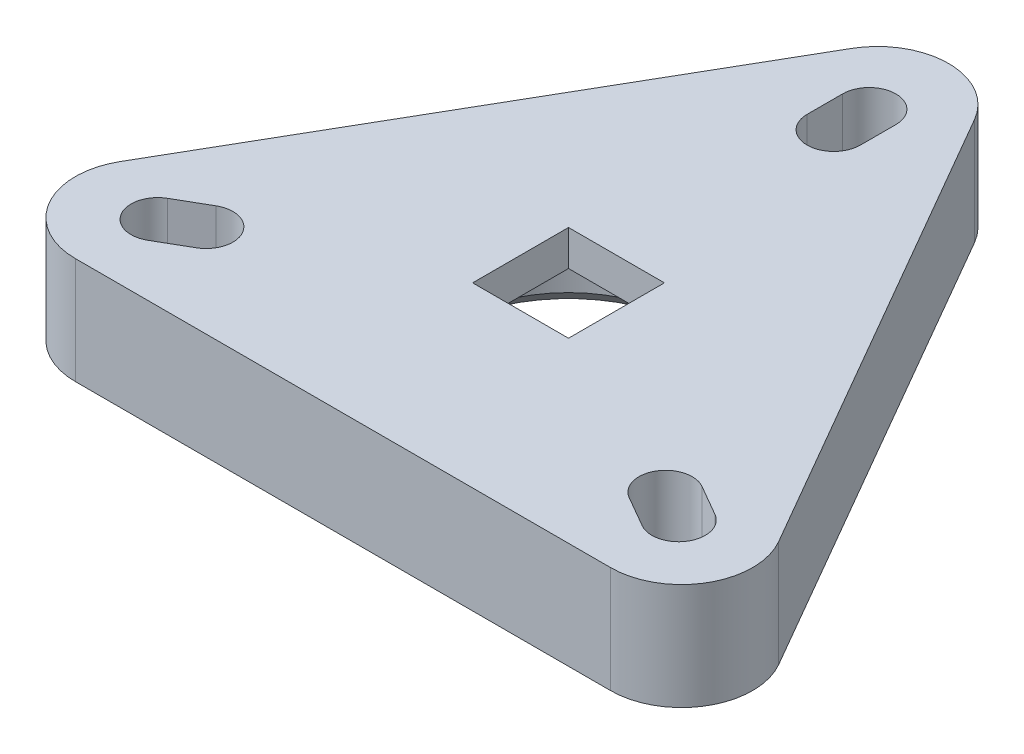
ISO-10303-21;
HEADER;
FILE_DESCRIPTION(('STEP AP214'),'2;1');
FILE_NAME('part.step','',(''),(''),'','','');
FILE_SCHEMA(('AUTOMOTIVE_DESIGN { 1 0 10303 214 1 1 1 1 }'));
ENDSEC;
DATA;
#1=APPLICATION_CONTEXT('core data for automotive mechanical design processes');
#2=APPLICATION_PROTOCOL_DEFINITION('international standard','automotive_design',2000,#1);
#3=PRODUCT_CONTEXT('',#1,'mechanical');
#4=PRODUCT('Part','Part','',(#3));
#5=PRODUCT_RELATED_PRODUCT_CATEGORY('part','',(#4));
#6=PRODUCT_DEFINITION_FORMATION('','',#4);
#7=PRODUCT_DEFINITION_CONTEXT('part definition',#1,'design');
#8=PRODUCT_DEFINITION('design','',#6,#7);
#9=PRODUCT_DEFINITION_SHAPE('','',#8);
#10=(LENGTH_UNIT() NAMED_UNIT(*) SI_UNIT(.MILLI.,.METRE.));
#11=(NAMED_UNIT(*) PLANE_ANGLE_UNIT() SI_UNIT($,.RADIAN.));
#12=(NAMED_UNIT(*) SI_UNIT($,.STERADIAN.) SOLID_ANGLE_UNIT());
#13=UNCERTAINTY_MEASURE_WITH_UNIT(LENGTH_MEASURE(1.E-05),#10,'distance_accuracy_value','');
#14=(GEOMETRIC_REPRESENTATION_CONTEXT(3) GLOBAL_UNCERTAINTY_ASSIGNED_CONTEXT((#13)) GLOBAL_UNIT_ASSIGNED_CONTEXT((#10,
#11,#12)) REPRESENTATION_CONTEXT('',''));
#15=CARTESIAN_POINT('',(0.,0.,0.));
#16=DIRECTION('',(0.,0.,1.));
#17=DIRECTION('',(1.,0.,0.));
#18=AXIS2_PLACEMENT_3D('',#15,#16,#17);
#19=CARTESIAN_POINT('',(0.,7.62,-21.5072816356348));
#20=DIRECTION('',(0.,-1.,0.));
#21=DIRECTION('',(0.,0.,-1.));
#22=AXIS2_PLACEMENT_3D('',#19,#20,#21);
#23=CYLINDRICAL_SURFACE('',#22,1.905);
#24=CARTESIAN_POINT('',(0.,0.,-21.5072816356348));
#25=DIRECTION('',(0.,1.,0.));
#26=DIRECTION('',(0.,0.,1.));
#27=AXIS2_PLACEMENT_3D('',#24,#25,#26);
#28=CIRCLE('',#27,1.905);
#29=CARTESIAN_POINT('',(1.90500000000001,0.,-21.5072816356348));
#30=VERTEX_POINT('',#29);
#31=CARTESIAN_POINT('',(-1.90499999999999,0.,-21.5072816356348));
#32=VERTEX_POINT('',#31);
#33=EDGE_CURVE('E312',#30,#32,#28,.T.);
#34=ORIENTED_EDGE('',*,*,#33,.F.);
#35=DIRECTION('',(0.,-1.,0.));
#36=VECTOR('',#35,1.);
#37=CARTESIAN_POINT('',(1.90500000000001,7.62,-21.5072816356348));
#38=LINE('',#37,#36);
#39=CARTESIAN_POINT('',(1.90500000000001,7.62,-21.5072816356348));
#40=VERTEX_POINT('',#39);
#41=EDGE_CURVE('E330',#40,#30,#38,.T.);
#42=ORIENTED_EDGE('',*,*,#41,.F.);
#43=CARTESIAN_POINT('',(0.,7.62,-21.5072816356348));
#44=DIRECTION('',(0.,1.,0.));
#45=DIRECTION('',(0.,0.,1.));
#46=AXIS2_PLACEMENT_3D('',#43,#44,#45);
#47=CIRCLE('',#46,1.905);
#48=CARTESIAN_POINT('',(-1.90499999999999,7.62,-21.5072816356348));
#49=VERTEX_POINT('',#48);
#50=EDGE_CURVE('E259',#40,#49,#47,.T.);
#51=ORIENTED_EDGE('',*,*,#50,.T.);
#52=DIRECTION('',(0.,-1.,0.));
#53=VECTOR('',#52,1.);
#54=CARTESIAN_POINT('',(-1.90499999999999,7.62,-21.5072816356348));
#55=LINE('',#54,#53);
#56=EDGE_CURVE('E323',#49,#32,#55,.T.);
#57=ORIENTED_EDGE('',*,*,#56,.T.);
#58=EDGE_LOOP('',(#34,#42,#51,#57));
#59=FACE_BOUND('',#58,.T.);
#60=ADVANCED_FACE('F37',(#59),#23,.F.);
#61=CARTESIAN_POINT('',(1.905,7.62,0.));
#62=DIRECTION('',(-1.,0.,0.));
#63=DIRECTION('',(0.,0.,1.));
#64=AXIS2_PLACEMENT_3D('',#61,#62,#63);
#65=PLANE('',#64);
#66=DIRECTION('',(0.,0.,-1.));
#67=VECTOR('',#66,1.);
#68=CARTESIAN_POINT('',(1.905,0.,0.));
#69=LINE('',#68,#67);
#70=CARTESIAN_POINT('',(1.90500000000001,0.,-18.9672816356348));
#71=VERTEX_POINT('',#70);
#72=EDGE_CURVE('E315',#71,#30,#69,.T.);
#73=ORIENTED_EDGE('',*,*,#72,.F.);
#74=DIRECTION('',(0.,-1.,0.));
#75=VECTOR('',#74,1.);
#76=CARTESIAN_POINT('',(1.90500000000001,7.62,-18.9672816356348));
#77=LINE('',#76,#75);
#78=CARTESIAN_POINT('',(1.90500000000001,7.62,-18.9672816356348));
#79=VERTEX_POINT('',#78);
#80=EDGE_CURVE('E328',#79,#71,#77,.T.);
#81=ORIENTED_EDGE('',*,*,#80,.F.);
#82=DIRECTION('',(0.,0.,-1.));
#83=VECTOR('',#82,1.);
#84=CARTESIAN_POINT('',(1.905,7.62,0.));
#85=LINE('',#84,#83);
#86=EDGE_CURVE('E262',#79,#40,#85,.T.);
#87=ORIENTED_EDGE('',*,*,#86,.T.);
#88=ORIENTED_EDGE('',*,*,#41,.T.);
#89=EDGE_LOOP('',(#73,#81,#87,#88));
#90=FACE_BOUND('',#89,.T.);
#91=ADVANCED_FACE('F379',(#90),#65,.T.);
#92=CARTESIAN_POINT('',(0.,7.62,-18.9672816356348));
#93=DIRECTION('',(0.,-1.,0.));
#94=DIRECTION('',(0.,0.,-1.));
#95=AXIS2_PLACEMENT_3D('',#92,#93,#94);
#96=CYLINDRICAL_SURFACE('',#95,1.905);
#97=CARTESIAN_POINT('',(0.,0.,-18.9672816356348));
#98=DIRECTION('',(0.,1.,0.));
#99=DIRECTION('',(0.,0.,1.));
#100=AXIS2_PLACEMENT_3D('',#97,#98,#99);
#101=CIRCLE('',#100,1.905);
#102=CARTESIAN_POINT('',(-1.905,0.,-18.9672816356348));
#103=VERTEX_POINT('',#102);
#104=EDGE_CURVE('E318',#103,#71,#101,.T.);
#105=ORIENTED_EDGE('',*,*,#104,.F.);
#106=DIRECTION('',(0.,-1.,0.));
#107=VECTOR('',#106,1.);
#108=CARTESIAN_POINT('',(-1.905,7.62,-18.9672816356348));
#109=LINE('',#108,#107);
#110=CARTESIAN_POINT('',(-1.905,7.62,-18.9672816356348));
#111=VERTEX_POINT('',#110);
#112=EDGE_CURVE('E325',#111,#103,#109,.T.);
#113=ORIENTED_EDGE('',*,*,#112,.F.);
#114=CARTESIAN_POINT('',(0.,7.62,-18.9672816356348));
#115=DIRECTION('',(0.,1.,0.));
#116=DIRECTION('',(0.,0.,1.));
#117=AXIS2_PLACEMENT_3D('',#114,#115,#116);
#118=CIRCLE('',#117,1.905);
#119=EDGE_CURVE('E265',#111,#79,#118,.T.);
#120=ORIENTED_EDGE('',*,*,#119,.T.);
#121=ORIENTED_EDGE('',*,*,#80,.T.);
#122=EDGE_LOOP('',(#105,#113,#120,#121));
#123=FACE_BOUND('',#122,.T.);
#124=ADVANCED_FACE('F385',(#123),#96,.F.);
#125=CARTESIAN_POINT('',(-16.4261477371938,7.62,9.48364081781738));
#126=DIRECTION('',(0.,-1.,0.));
#127=DIRECTION('',(0.,0.,-1.));
#128=AXIS2_PLACEMENT_3D('',#125,#126,#127);
#129=CYLINDRICAL_SURFACE('',#128,1.905);
#130=CARTESIAN_POINT('',(-16.4261477371938,0.,9.48364081781738));
#131=DIRECTION('',(0.,1.,0.));
#132=DIRECTION('',(0.,0.,1.));
#133=AXIS2_PLACEMENT_3D('',#130,#131,#132);
#134=CIRCLE('',#133,1.905);
#135=CARTESIAN_POINT('',(-15.4736477371938,0.,11.1334192120267));
#136=VERTEX_POINT('',#135);
#137=CARTESIAN_POINT('',(-17.3786477371938,0.,7.83386242360801));
#138=VERTEX_POINT('',#137);
#139=EDGE_CURVE('E300',#136,#138,#134,.T.);
#140=ORIENTED_EDGE('',*,*,#139,.F.);
#141=DIRECTION('',(0.,-1.,0.));
#142=VECTOR('',#141,1.);
#143=CARTESIAN_POINT('',(-15.4736477371938,7.62,11.1334192120267));
#144=LINE('',#143,#142);
#145=CARTESIAN_POINT('',(-15.4736477371938,7.62,11.1334192120267));
#146=VERTEX_POINT('',#145);
#147=EDGE_CURVE('E326',#146,#136,#144,.T.);
#148=ORIENTED_EDGE('',*,*,#147,.F.);
#149=CARTESIAN_POINT('',(-16.4261477371938,7.62,9.48364081781738));
#150=DIRECTION('',(0.,1.,0.));
#151=DIRECTION('',(0.,0.,1.));
#152=AXIS2_PLACEMENT_3D('',#149,#150,#151);
#153=CIRCLE('',#152,1.905);
#154=CARTESIAN_POINT('',(-17.3786477371938,7.62,7.83386242360801));
#155=VERTEX_POINT('',#154);
#156=EDGE_CURVE('E248',#146,#155,#153,.T.);
#157=ORIENTED_EDGE('',*,*,#156,.T.);
#158=DIRECTION('',(0.,-1.,0.));
#159=VECTOR('',#158,1.);
#160=CARTESIAN_POINT('',(-17.3786477371938,7.62,7.83386242360801));
#161=LINE('',#160,#159);
#162=EDGE_CURVE('E333',#155,#138,#161,.T.);
#163=ORIENTED_EDGE('',*,*,#162,.T.);
#164=EDGE_LOOP('',(#140,#148,#157,#163));
#165=FACE_BOUND('',#164,.T.);
#166=ADVANCED_FACE('F405',(#165),#129,.F.);
#167=CARTESIAN_POINT('',(0.952499999999998,7.62,1.64977839420935));
#168=DIRECTION('',(-0.5,0.,-0.866025403784438));
#169=DIRECTION('',(-0.866025403784439,0.,0.5));
#170=AXIS2_PLACEMENT_3D('',#167,#168,#169);
#171=PLANE('',#170);
#172=DIRECTION('',(0.866025403784439,0.,-0.5));
#173=VECTOR('',#172,1.);
#174=CARTESIAN_POINT('',(0.952499999999998,0.,1.64977839420935));
#175=LINE('',#174,#173);
#176=CARTESIAN_POINT('',(-17.6733522628062,0.,12.4034192120267));
#177=VERTEX_POINT('',#176);
#178=EDGE_CURVE('E303',#177,#136,#175,.T.);
#179=ORIENTED_EDGE('',*,*,#178,.F.);
#180=DIRECTION('',(0.,-1.,0.));
#181=VECTOR('',#180,1.);
#182=CARTESIAN_POINT('',(-17.6733522628062,7.62,12.4034192120267));
#183=LINE('',#182,#181);
#184=CARTESIAN_POINT('',(-17.6733522628062,7.62,12.4034192120267));
#185=VERTEX_POINT('',#184);
#186=EDGE_CURVE('E338',#185,#177,#183,.T.);
#187=ORIENTED_EDGE('',*,*,#186,.F.);
#188=DIRECTION('',(0.866025403784439,0.,-0.5));
#189=VECTOR('',#188,1.);
#190=CARTESIAN_POINT('',(0.952499999999998,7.62,1.64977839420935));
#191=LINE('',#190,#189);
#192=EDGE_CURVE('E251',#185,#146,#191,.T.);
#193=ORIENTED_EDGE('',*,*,#192,.T.);
#194=ORIENTED_EDGE('',*,*,#147,.T.);
#195=EDGE_LOOP('',(#179,#187,#193,#194));
#196=FACE_BOUND('',#195,.T.);
#197=ADVANCED_FACE('F401',(#196),#171,.T.);
#198=CARTESIAN_POINT('',(-18.6258522628062,7.62,10.7536408178174));
#199=DIRECTION('',(0.,-1.,0.));
#200=DIRECTION('',(0.,0.,-1.));
#201=AXIS2_PLACEMENT_3D('',#198,#199,#200);
#202=CYLINDRICAL_SURFACE('',#201,1.905);
#203=CARTESIAN_POINT('',(-18.6258522628062,0.,10.7536408178174));
#204=DIRECTION('',(0.,1.,0.));
#205=DIRECTION('',(0.,0.,1.));
#206=AXIS2_PLACEMENT_3D('',#203,#204,#205);
#207=CIRCLE('',#206,1.905);
#208=CARTESIAN_POINT('',(-19.5783522628062,0.,9.10386242360802));
#209=VERTEX_POINT('',#208);
#210=EDGE_CURVE('E306',#209,#177,#207,.T.);
#211=ORIENTED_EDGE('',*,*,#210,.F.);
#212=DIRECTION('',(0.,-1.,0.));
#213=VECTOR('',#212,1.);
#214=CARTESIAN_POINT('',(-19.5783522628062,7.62,9.10386242360802));
#215=LINE('',#214,#213);
#216=CARTESIAN_POINT('',(-19.5783522628062,7.62,9.10386242360802));
#217=VERTEX_POINT('',#216);
#218=EDGE_CURVE('E335',#217,#209,#215,.T.);
#219=ORIENTED_EDGE('',*,*,#218,.F.);
#220=CARTESIAN_POINT('',(-18.6258522628062,7.62,10.7536408178174));
#221=DIRECTION('',(0.,1.,0.));
#222=DIRECTION('',(0.,0.,1.));
#223=AXIS2_PLACEMENT_3D('',#220,#221,#222);
#224=CIRCLE('',#223,1.905);
#225=EDGE_CURVE('E254',#217,#185,#224,.T.);
#226=ORIENTED_EDGE('',*,*,#225,.T.);
#227=ORIENTED_EDGE('',*,*,#186,.T.);
#228=EDGE_LOOP('',(#211,#219,#226,#227));
#229=FACE_BOUND('',#228,.T.);
#230=ADVANCED_FACE('F397',(#229),#202,.F.);
#231=CARTESIAN_POINT('',(18.6258522628062,7.62,10.7536408178174));
#232=DIRECTION('',(0.,-1.,0.));
#233=DIRECTION('',(0.,0.,-1.));
#234=AXIS2_PLACEMENT_3D('',#231,#232,#233);
#235=CYLINDRICAL_SURFACE('',#234,1.905);
#236=CARTESIAN_POINT('',(18.6258522628062,0.,10.7536408178174));
#237=DIRECTION('',(0.,1.,0.));
#238=DIRECTION('',(0.,0.,1.));
#239=AXIS2_PLACEMENT_3D('',#236,#237,#238);
#240=CIRCLE('',#239,1.905);
#241=CARTESIAN_POINT('',(17.6733522628062,0.,12.4034192120267));
#242=VERTEX_POINT('',#241);
#243=CARTESIAN_POINT('',(19.5783522628062,0.,9.10386242360802));
#244=VERTEX_POINT('',#243);
#245=EDGE_CURVE('E288',#242,#244,#240,.T.);
#246=ORIENTED_EDGE('',*,*,#245,.F.);
#247=DIRECTION('',(0.,-1.,0.));
#248=VECTOR('',#247,1.);
#249=CARTESIAN_POINT('',(17.6733522628062,7.62,12.4034192120267));
#250=LINE('',#249,#248);
#251=CARTESIAN_POINT('',(17.6733522628062,7.62,12.4034192120267));
#252=VERTEX_POINT('',#251);
#253=EDGE_CURVE('E336',#252,#242,#250,.T.);
#254=ORIENTED_EDGE('',*,*,#253,.F.);
#255=CARTESIAN_POINT('',(18.6258522628062,7.62,10.7536408178174));
#256=DIRECTION('',(0.,1.,0.));
#257=DIRECTION('',(0.,0.,1.));
#258=AXIS2_PLACEMENT_3D('',#255,#256,#257);
#259=CIRCLE('',#258,1.905);
#260=CARTESIAN_POINT('',(19.5783522628062,7.62,9.10386242360802));
#261=VERTEX_POINT('',#260);
#262=EDGE_CURVE('E237',#252,#261,#259,.T.);
#263=ORIENTED_EDGE('',*,*,#262,.T.);
#264=DIRECTION('',(0.,-1.,0.));
#265=VECTOR('',#264,1.);
#266=CARTESIAN_POINT('',(19.5783522628062,7.62,9.10386242360802));
#267=LINE('',#266,#265);
#268=EDGE_CURVE('E341',#261,#244,#267,.T.);
#269=ORIENTED_EDGE('',*,*,#268,.T.);
#270=EDGE_LOOP('',(#246,#254,#263,#269));
#271=FACE_BOUND('',#270,.T.);
#272=ADVANCED_FACE('F400',(#271),#235,.F.);
#273=CARTESIAN_POINT('',(-0.952500000000003,7.62,1.64977839420936));
#274=DIRECTION('',(0.5,0.,-0.866025403784439));
#275=DIRECTION('',(-0.866025403784439,0.,-0.5));
#276=AXIS2_PLACEMENT_3D('',#273,#274,#275);
#277=PLANE('',#276);
#278=DIRECTION('',(0.866025403784439,0.,0.5));
#279=VECTOR('',#278,1.);
#280=CARTESIAN_POINT('',(-0.952500000000003,0.,1.64977839420936));
#281=LINE('',#280,#279);
#282=CARTESIAN_POINT('',(15.4736477371937,0.,11.1334192120267));
#283=VERTEX_POINT('',#282);
#284=EDGE_CURVE('E291',#283,#242,#281,.T.);
#285=ORIENTED_EDGE('',*,*,#284,.F.);
#286=DIRECTION('',(0.,-1.,0.));
#287=VECTOR('',#286,1.);
#288=CARTESIAN_POINT('',(15.4736477371937,7.62,11.1334192120267));
#289=LINE('',#288,#287);
#290=CARTESIAN_POINT('',(15.4736477371937,7.62,11.1334192120267));
#291=VERTEX_POINT('',#290);
#292=EDGE_CURVE('E346',#291,#283,#289,.T.);
#293=ORIENTED_EDGE('',*,*,#292,.F.);
#294=DIRECTION('',(0.866025403784439,0.,0.5));
#295=VECTOR('',#294,1.);
#296=CARTESIAN_POINT('',(-0.952500000000003,7.62,1.64977839420936));
#297=LINE('',#296,#295);
#298=EDGE_CURVE('E240',#291,#252,#297,.T.);
#299=ORIENTED_EDGE('',*,*,#298,.T.);
#300=ORIENTED_EDGE('',*,*,#253,.T.);
#301=EDGE_LOOP('',(#285,#293,#299,#300));
#302=FACE_BOUND('',#301,.T.);
#303=ADVANCED_FACE('F418',(#302),#277,.T.);
#304=CARTESIAN_POINT('',(16.4261477371937,7.62,9.48364081781738));
#305=DIRECTION('',(0.,-1.,0.));
#306=DIRECTION('',(0.,0.,-1.));
#307=AXIS2_PLACEMENT_3D('',#304,#305,#306);
#308=CYLINDRICAL_SURFACE('',#307,1.905);
#309=CARTESIAN_POINT('',(16.4261477371937,0.,9.48364081781738));
#310=DIRECTION('',(0.,1.,0.));
#311=DIRECTION('',(0.,0.,1.));
#312=AXIS2_PLACEMENT_3D('',#309,#310,#311);
#313=CIRCLE('',#312,1.905);
#314=CARTESIAN_POINT('',(17.3786477371937,0.,7.83386242360802));
#315=VERTEX_POINT('',#314);
#316=EDGE_CURVE('E294',#315,#283,#313,.T.);
#317=ORIENTED_EDGE('',*,*,#316,.F.);
#318=DIRECTION('',(0.,-1.,0.));
#319=VECTOR('',#318,1.);
#320=CARTESIAN_POINT('',(17.3786477371937,7.62,7.83386242360802));
#321=LINE('',#320,#319);
#322=CARTESIAN_POINT('',(17.3786477371937,7.62,7.83386242360802));
#323=VERTEX_POINT('',#322);
#324=EDGE_CURVE('E343',#323,#315,#321,.T.);
#325=ORIENTED_EDGE('',*,*,#324,.F.);
#326=CARTESIAN_POINT('',(16.4261477371937,7.62,9.48364081781738));
#327=DIRECTION('',(0.,1.,0.));
#328=DIRECTION('',(0.,0.,1.));
#329=AXIS2_PLACEMENT_3D('',#326,#327,#328);
#330=CIRCLE('',#329,1.905);
#331=EDGE_CURVE('E243',#323,#291,#330,.T.);
#332=ORIENTED_EDGE('',*,*,#331,.T.);
#333=ORIENTED_EDGE('',*,*,#292,.T.);
#334=EDGE_LOOP('',(#317,#325,#332,#333));
#335=FACE_BOUND('',#334,.T.);
#336=ADVANCED_FACE('F414',(#335),#308,.F.);
#337=CARTESIAN_POINT('',(0.,7.62,-22.1023330423163));
#338=DIRECTION('',(0.,-1.,0.));
#339=DIRECTION('',(0.,0.,-1.));
#340=AXIS2_PLACEMENT_3D('',#337,#338,#339);
#341=CYLINDRICAL_SURFACE('',#340,5.08);
#342=CARTESIAN_POINT('',(0.,0.,-22.1023330423163));
#343=DIRECTION('',(0.,1.,0.));
#344=DIRECTION('',(0.,0.,1.));
#345=AXIS2_PLACEMENT_3D('',#342,#343,#344);
#346=CIRCLE('',#345,5.08);
#347=CARTESIAN_POINT('',(-4.39940905122494,0.,-24.6423330423163));
#348=VERTEX_POINT('',#347);
#349=CARTESIAN_POINT('',(4.39940905122496,0.,-24.6423330423163));
#350=VERTEX_POINT('',#349);
#351=EDGE_CURVE('E218',#348,#350,#346,.F.);
#352=ORIENTED_EDGE('',*,*,#351,.F.);
#353=DIRECTION('',(0.,-1.,0.));
#354=VECTOR('',#353,1.);
#355=CARTESIAN_POINT('',(-4.39940905122494,7.62,-24.6423330423163));
#356=LINE('',#355,#354);
#357=CARTESIAN_POINT('',(-4.39940905122494,7.62,-24.6423330423163));
#358=VERTEX_POINT('',#357);
#359=EDGE_CURVE('E344',#358,#348,#356,.T.);
#360=ORIENTED_EDGE('',*,*,#359,.F.);
#361=CARTESIAN_POINT('',(0.,7.62,-22.1023330423163));
#362=DIRECTION('',(0.,1.,0.));
#363=DIRECTION('',(0.,0.,1.));
#364=AXIS2_PLACEMENT_3D('',#361,#362,#363);
#365=CIRCLE('',#364,5.08);
#366=CARTESIAN_POINT('',(4.39940905122496,7.62,-24.6423330423163));
#367=VERTEX_POINT('',#366);
#368=EDGE_CURVE('E219',#358,#367,#365,.F.);
#369=ORIENTED_EDGE('',*,*,#368,.T.);
#370=DIRECTION('',(0.,-1.,0.));
#371=VECTOR('',#370,1.);
#372=CARTESIAN_POINT('',(4.39940905122496,7.62,-24.6423330423163));
#373=LINE('',#372,#371);
#374=EDGE_CURVE('E270',#367,#350,#373,.T.);
#375=ORIENTED_EDGE('',*,*,#374,.T.);
#376=EDGE_LOOP('',(#352,#360,#369,#375));
#377=FACE_BOUND('',#376,.T.);
#378=ADVANCED_FACE('F417',(#377),#341,.T.);
#379=CARTESIAN_POINT('',(-13.97,7.62,-8.06558326057907));
#380=DIRECTION('',(-0.866025403784439,0.,-0.5));
#381=DIRECTION('',(-0.5,0.,0.866025403784439));
#382=AXIS2_PLACEMENT_3D('',#379,#380,#381);
#383=PLANE('',#382);
#384=DIRECTION('',(0.5,0.,-0.866025403784439));
#385=VECTOR('',#384,1.);
#386=CARTESIAN_POINT('',(-13.97,0.,-8.06558326057907));
#387=LINE('',#386,#385);
#388=CARTESIAN_POINT('',(-23.5405909487751,0.,8.51116652115814));
#389=VERTEX_POINT('',#388);
#390=EDGE_CURVE('E273',#389,#348,#387,.T.);
#391=ORIENTED_EDGE('',*,*,#390,.F.);
#392=DIRECTION('',(0.,-1.,0.));
#393=VECTOR('',#392,1.);
#394=CARTESIAN_POINT('',(-23.5405909487751,7.62,8.51116652115814));
#395=LINE('',#394,#393);
#396=CARTESIAN_POINT('',(-23.5405909487751,7.62,8.51116652115814));
#397=VERTEX_POINT('',#396);
#398=EDGE_CURVE('E356',#397,#389,#395,.T.);
#399=ORIENTED_EDGE('',*,*,#398,.F.);
#400=DIRECTION('',(0.5,0.,-0.866025403784439));
#401=VECTOR('',#400,1.);
#402=CARTESIAN_POINT('',(-13.97,7.62,-8.06558326057907));
#403=LINE('',#402,#401);
#404=EDGE_CURVE('E222',#397,#358,#403,.T.);
#405=ORIENTED_EDGE('',*,*,#404,.T.);
#406=ORIENTED_EDGE('',*,*,#359,.T.);
#407=EDGE_LOOP('',(#391,#399,#405,#406));
#408=FACE_BOUND('',#407,.T.);
#409=ADVANCED_FACE('F440',(#408),#383,.T.);
#410=CARTESIAN_POINT('',(-19.1411818975501,7.62,11.0511665211581));
#411=DIRECTION('',(0.,-1.,0.));
#412=DIRECTION('',(0.,0.,-1.));
#413=AXIS2_PLACEMENT_3D('',#410,#411,#412);
#414=CYLINDRICAL_SURFACE('',#413,5.08);
#415=CARTESIAN_POINT('',(-19.1411818975501,0.,11.0511665211581));
#416=DIRECTION('',(0.,1.,0.));
#417=DIRECTION('',(0.,0.,1.));
#418=AXIS2_PLACEMENT_3D('',#415,#416,#417);
#419=CIRCLE('',#418,5.08);
#420=CARTESIAN_POINT('',(-19.1411818975501,0.,16.1311665211581));
#421=VERTEX_POINT('',#420);
#422=EDGE_CURVE('E276',#389,#421,#419,.T.);
#423=ORIENTED_EDGE('',*,*,#422,.T.);
#424=DIRECTION('',(0.,-1.,0.));
#425=VECTOR('',#424,1.);
#426=CARTESIAN_POINT('',(-19.1411818975501,7.62,16.1311665211581));
#427=LINE('',#426,#425);
#428=CARTESIAN_POINT('',(-19.1411818975501,7.62,16.1311665211581));
#429=VERTEX_POINT('',#428);
#430=EDGE_CURVE('E354',#429,#421,#427,.T.);
#431=ORIENTED_EDGE('',*,*,#430,.F.);
#432=CARTESIAN_POINT('',(-19.1411818975501,7.62,11.0511665211581));
#433=DIRECTION('',(0.,1.,0.));
#434=DIRECTION('',(0.,0.,1.));
#435=AXIS2_PLACEMENT_3D('',#432,#433,#434);
#436=CIRCLE('',#435,5.08);
#437=EDGE_CURVE('E226',#397,#429,#436,.T.);
#438=ORIENTED_EDGE('',*,*,#437,.F.);
#439=ORIENTED_EDGE('',*,*,#398,.T.);
#440=EDGE_LOOP('',(#423,#431,#438,#439));
#441=FACE_BOUND('',#440,.T.);
#442=ADVANCED_FACE('F436',(#441),#414,.T.);
#443=CARTESIAN_POINT('',(0.,7.62,16.1311665211581));
#444=DIRECTION('',(0.,0.,1.));
#445=DIRECTION('',(1.,0.,0.));
#446=AXIS2_PLACEMENT_3D('',#443,#444,#445);
#447=PLANE('',#446);
#448=DIRECTION('',(-1.,0.,0.));
#449=VECTOR('',#448,1.);
#450=CARTESIAN_POINT('',(0.,0.,16.1311665211581));
#451=LINE('',#450,#449);
#452=CARTESIAN_POINT('',(19.1411818975501,0.,16.1311665211581));
#453=VERTEX_POINT('',#452);
#454=EDGE_CURVE('E279',#453,#421,#451,.T.);
#455=ORIENTED_EDGE('',*,*,#454,.F.);
#456=DIRECTION('',(0.,-1.,0.));
#457=VECTOR('',#456,1.);
#458=CARTESIAN_POINT('',(19.1411818975501,7.62,16.1311665211581));
#459=LINE('',#458,#457);
#460=CARTESIAN_POINT('',(19.1411818975501,7.62,16.1311665211581));
#461=VERTEX_POINT('',#460);
#462=EDGE_CURVE('E352',#461,#453,#459,.T.);
#463=ORIENTED_EDGE('',*,*,#462,.F.);
#464=DIRECTION('',(-1.,0.,0.));
#465=VECTOR('',#464,1.);
#466=CARTESIAN_POINT('',(0.,7.62,16.1311665211581));
#467=LINE('',#466,#465);
#468=EDGE_CURVE('E228',#461,#429,#467,.T.);
#469=ORIENTED_EDGE('',*,*,#468,.T.);
#470=ORIENTED_EDGE('',*,*,#430,.T.);
#471=EDGE_LOOP('',(#455,#463,#469,#470));
#472=FACE_BOUND('',#471,.T.);
#473=ADVANCED_FACE('F432',(#472),#447,.T.);
#474=CARTESIAN_POINT('',(19.1411818975501,7.62,11.0511665211581));
#475=DIRECTION('',(0.,-1.,0.));
#476=DIRECTION('',(0.,0.,-1.));
#477=AXIS2_PLACEMENT_3D('',#474,#475,#476);
#478=CYLINDRICAL_SURFACE('',#477,5.08);
#479=CARTESIAN_POINT('',(19.1411818975501,0.,11.0511665211581));
#480=DIRECTION('',(0.,1.,0.));
#481=DIRECTION('',(0.,0.,1.));
#482=AXIS2_PLACEMENT_3D('',#479,#480,#481);
#483=CIRCLE('',#482,5.08);
#484=CARTESIAN_POINT('',(23.5405909487751,0.,8.51116652115815));
#485=VERTEX_POINT('',#484);
#486=EDGE_CURVE('E282',#485,#453,#483,.F.);
#487=ORIENTED_EDGE('',*,*,#486,.F.);
#488=DIRECTION('',(0.,-1.,0.));
#489=VECTOR('',#488,1.);
#490=CARTESIAN_POINT('',(23.5405909487751,7.62,8.51116652115815));
#491=LINE('',#490,#489);
#492=CARTESIAN_POINT('',(23.5405909487751,7.62,8.51116652115815));
#493=VERTEX_POINT('',#492);
#494=EDGE_CURVE('E350',#493,#485,#491,.T.);
#495=ORIENTED_EDGE('',*,*,#494,.F.);
#496=CARTESIAN_POINT('',(19.1411818975501,7.62,11.0511665211581));
#497=DIRECTION('',(0.,1.,0.));
#498=DIRECTION('',(0.,0.,1.));
#499=AXIS2_PLACEMENT_3D('',#496,#497,#498);
#500=CIRCLE('',#499,5.08);
#501=EDGE_CURVE('E231',#493,#461,#500,.F.);
#502=ORIENTED_EDGE('',*,*,#501,.T.);
#503=ORIENTED_EDGE('',*,*,#462,.T.);
#504=EDGE_LOOP('',(#487,#495,#502,#503));
#505=FACE_BOUND('',#504,.T.);
#506=ADVANCED_FACE('F395',(#505),#478,.T.);
#507=CARTESIAN_POINT('',(-0.952500000000005,7.62,-1.64977839420936));
#508=DIRECTION('',(-0.5,0.,-0.866025403784439));
#509=DIRECTION('',(-0.866025403784439,0.,0.5));
#510=AXIS2_PLACEMENT_3D('',#507,#508,#509);
#511=PLANE('',#510);
#512=DIRECTION('',(0.866025403784439,0.,-0.5));
#513=VECTOR('',#512,1.);
#514=CARTESIAN_POINT('',(-0.952500000000005,0.,-1.64977839420936));
#515=LINE('',#514,#513);
#516=EDGE_CURVE('E309',#209,#138,#515,.T.);
#517=ORIENTED_EDGE('',*,*,#516,.T.);
#518=ORIENTED_EDGE('',*,*,#162,.F.);
#519=DIRECTION('',(0.866025403784439,0.,-0.5));
#520=VECTOR('',#519,1.);
#521=CARTESIAN_POINT('',(-0.952500000000005,7.62,-1.64977839420936));
#522=LINE('',#521,#520);
#523=EDGE_CURVE('E257',#217,#155,#522,.T.);
#524=ORIENTED_EDGE('',*,*,#523,.F.);
#525=ORIENTED_EDGE('',*,*,#218,.T.);
#526=EDGE_LOOP('',(#517,#518,#524,#525));
#527=FACE_BOUND('',#526,.T.);
#528=ADVANCED_FACE('F391',(#527),#511,.F.);
#529=CARTESIAN_POINT('',(0.952499999999999,7.62,-1.64977839420935));
#530=DIRECTION('',(0.5,0.,-0.866025403784439));
#531=DIRECTION('',(-0.866025403784439,0.,-0.5));
#532=AXIS2_PLACEMENT_3D('',#529,#530,#531);
#533=PLANE('',#532);
#534=DIRECTION('',(0.866025403784439,0.,0.5));
#535=VECTOR('',#534,1.);
#536=CARTESIAN_POINT('',(0.952499999999999,0.,-1.64977839420935));
#537=LINE('',#536,#535);
#538=EDGE_CURVE('E297',#315,#244,#537,.T.);
#539=ORIENTED_EDGE('',*,*,#538,.T.);
#540=ORIENTED_EDGE('',*,*,#268,.F.);
#541=DIRECTION('',(0.866025403784439,0.,0.5));
#542=VECTOR('',#541,1.);
#543=CARTESIAN_POINT('',(0.952499999999999,7.62,-1.64977839420935));
#544=LINE('',#543,#542);
#545=EDGE_CURVE('E246',#323,#261,#544,.T.);
#546=ORIENTED_EDGE('',*,*,#545,.F.);
#547=ORIENTED_EDGE('',*,*,#324,.T.);
#548=EDGE_LOOP('',(#539,#540,#546,#547));
#549=FACE_BOUND('',#548,.T.);
#550=ADVANCED_FACE('F394',(#549),#533,.F.);
#551=CARTESIAN_POINT('',(13.97,7.62,-8.06558326057907));
#552=DIRECTION('',(0.866025403784439,0.,-0.5));
#553=DIRECTION('',(-0.5,0.,-0.866025403784439));
#554=AXIS2_PLACEMENT_3D('',#551,#552,#553);
#555=PLANE('',#554);
#556=DIRECTION('',(0.5,0.,0.866025403784439));
#557=VECTOR('',#556,1.);
#558=CARTESIAN_POINT('',(13.97,0.,-8.06558326057907));
#559=LINE('',#558,#557);
#560=EDGE_CURVE('E285',#350,#485,#559,.T.);
#561=ORIENTED_EDGE('',*,*,#560,.F.);
#562=ORIENTED_EDGE('',*,*,#374,.F.);
#563=DIRECTION('',(0.5,0.,0.866025403784439));
#564=VECTOR('',#563,1.);
#565=CARTESIAN_POINT('',(13.97,7.62,-8.06558326057907));
#566=LINE('',#565,#564);
#567=EDGE_CURVE('E234',#367,#493,#566,.T.);
#568=ORIENTED_EDGE('',*,*,#567,.T.);
#569=ORIENTED_EDGE('',*,*,#494,.T.);
#570=EDGE_LOOP('',(#561,#562,#568,#569));
#571=FACE_BOUND('',#570,.T.);
#572=ADVANCED_FACE('F412',(#571),#555,.T.);
#573=CARTESIAN_POINT('',(-1.905,7.62,0.));
#574=DIRECTION('',(-1.,0.,0.));
#575=DIRECTION('',(0.,0.,1.));
#576=AXIS2_PLACEMENT_3D('',#573,#574,#575);
#577=PLANE('',#576);
#578=DIRECTION('',(0.,0.,-1.));
#579=VECTOR('',#578,1.);
#580=CARTESIAN_POINT('',(-1.905,0.,0.));
#581=LINE('',#580,#579);
#582=EDGE_CURVE('E223',#103,#32,#581,.T.);
#583=ORIENTED_EDGE('',*,*,#582,.T.);
#584=ORIENTED_EDGE('',*,*,#56,.F.);
#585=DIRECTION('',(0.,0.,-1.));
#586=VECTOR('',#585,1.);
#587=CARTESIAN_POINT('',(-1.905,7.62,0.));
#588=LINE('',#587,#586);
#589=EDGE_CURVE('E268',#111,#49,#588,.T.);
#590=ORIENTED_EDGE('',*,*,#589,.F.);
#591=ORIENTED_EDGE('',*,*,#112,.T.);
#592=EDGE_LOOP('',(#583,#584,#590,#591));
#593=FACE_BOUND('',#592,.T.);
#594=ADVANCED_FACE('F428',(#593),#577,.F.);
#595=CARTESIAN_POINT('',(0.,7.62,0.));
#596=DIRECTION('',(0.,1.,0.));
#597=DIRECTION('',(0.,0.,1.));
#598=AXIS2_PLACEMENT_3D('',#595,#596,#597);
#599=PLANE('',#598);
#600=DIRECTION('',(0.,0.,1.));
#601=VECTOR('',#600,1.);
#602=CARTESIAN_POINT('',(3.429,7.62,-3.429));
#603=LINE('',#602,#601);
#604=CARTESIAN_POINT('',(3.429,7.62,-3.429));
#605=VERTEX_POINT('',#604);
#606=CARTESIAN_POINT('',(3.429,7.62,3.429));
#607=VERTEX_POINT('',#606);
#608=EDGE_CURVE('E189',#605,#607,#603,.T.);
#609=ORIENTED_EDGE('',*,*,#608,.T.);
#610=DIRECTION('',(-1.,0.,0.));
#611=VECTOR('',#610,1.);
#612=CARTESIAN_POINT('',(-3.429,7.62,3.429));
#613=LINE('',#612,#611);
#614=CARTESIAN_POINT('',(-3.429,7.62,3.429));
#615=VERTEX_POINT('',#614);
#616=EDGE_CURVE('E198',#607,#615,#613,.T.);
#617=ORIENTED_EDGE('',*,*,#616,.T.);
#618=DIRECTION('',(0.,0.,-1.));
#619=VECTOR('',#618,1.);
#620=CARTESIAN_POINT('',(-3.429,7.62,-3.429));
#621=LINE('',#620,#619);
#622=CARTESIAN_POINT('',(-3.429,7.62,-3.429));
#623=VERTEX_POINT('',#622);
#624=EDGE_CURVE('E52',#615,#623,#621,.T.);
#625=ORIENTED_EDGE('',*,*,#624,.T.);
#626=DIRECTION('',(1.,0.,0.));
#627=VECTOR('',#626,1.);
#628=CARTESIAN_POINT('',(-3.429,7.62,-3.429));
#629=LINE('',#628,#627);
#630=EDGE_CURVE('E195',#623,#605,#629,.T.);
#631=ORIENTED_EDGE('',*,*,#630,.T.);
#632=EDGE_LOOP('',(#609,#617,#625,#631));
#633=FACE_BOUND('',#632,.T.);
#634=ORIENTED_EDGE('',*,*,#368,.F.);
#635=ORIENTED_EDGE('',*,*,#404,.F.);
#636=ORIENTED_EDGE('',*,*,#437,.T.);
#637=ORIENTED_EDGE('',*,*,#468,.F.);
#638=ORIENTED_EDGE('',*,*,#501,.F.);
#639=ORIENTED_EDGE('',*,*,#567,.F.);
#640=EDGE_LOOP('',(#634,#635,#636,#637,#638,#639));
#641=FACE_BOUND('',#640,.T.);
#642=ORIENTED_EDGE('',*,*,#262,.F.);
#643=ORIENTED_EDGE('',*,*,#298,.F.);
#644=ORIENTED_EDGE('',*,*,#331,.F.);
#645=ORIENTED_EDGE('',*,*,#545,.T.);
#646=EDGE_LOOP('',(#642,#643,#644,#645));
#647=FACE_BOUND('',#646,.T.);
#648=ORIENTED_EDGE('',*,*,#156,.F.);
#649=ORIENTED_EDGE('',*,*,#192,.F.);
#650=ORIENTED_EDGE('',*,*,#225,.F.);
#651=ORIENTED_EDGE('',*,*,#523,.T.);
#652=EDGE_LOOP('',(#648,#649,#650,#651));
#653=FACE_BOUND('',#652,.T.);
#654=ORIENTED_EDGE('',*,*,#50,.F.);
#655=ORIENTED_EDGE('',*,*,#86,.F.);
#656=ORIENTED_EDGE('',*,*,#119,.F.);
#657=ORIENTED_EDGE('',*,*,#589,.T.);
#658=EDGE_LOOP('',(#654,#655,#656,#657));
#659=FACE_BOUND('',#658,.T.);
#660=ADVANCED_FACE('F202',(#633,#641,#647,#653,#659),#599,.T.);
#661=CARTESIAN_POINT('',(0.,0.,0.));
#662=DIRECTION('',(0.,1.,0.));
#663=DIRECTION('',(0.,0.,1.));
#664=AXIS2_PLACEMENT_3D('',#661,#662,#663);
#665=PLANE('',#664);
#666=CARTESIAN_POINT('',(0.,0.,0.));
#667=DIRECTION('',(0.,1.,0.));
#668=DIRECTION('',(0.,0.,1.));
#669=AXIS2_PLACEMENT_3D('',#666,#667,#668);
#670=CIRCLE('',#669,9.39800000000001);
#671=CARTESIAN_POINT('',(0.,0.,9.39800000000001));
#672=VERTEX_POINT('',#671);
#673=EDGE_CURVE('E11',#672,#672,#670,.T.);
#674=ORIENTED_EDGE('',*,*,#673,.T.);
#675=EDGE_LOOP('',(#674));
#676=FACE_BOUND('',#675,.T.);
#677=ORIENTED_EDGE('',*,*,#351,.T.);
#678=ORIENTED_EDGE('',*,*,#560,.T.);
#679=ORIENTED_EDGE('',*,*,#486,.T.);
#680=ORIENTED_EDGE('',*,*,#454,.T.);
#681=ORIENTED_EDGE('',*,*,#422,.F.);
#682=ORIENTED_EDGE('',*,*,#390,.T.);
#683=EDGE_LOOP('',(#677,#678,#679,#680,#681,#682));
#684=FACE_BOUND('',#683,.T.);
#685=ORIENTED_EDGE('',*,*,#245,.T.);
#686=ORIENTED_EDGE('',*,*,#538,.F.);
#687=ORIENTED_EDGE('',*,*,#316,.T.);
#688=ORIENTED_EDGE('',*,*,#284,.T.);
#689=EDGE_LOOP('',(#685,#686,#687,#688));
#690=FACE_BOUND('',#689,.T.);
#691=ORIENTED_EDGE('',*,*,#139,.T.);
#692=ORIENTED_EDGE('',*,*,#516,.F.);
#693=ORIENTED_EDGE('',*,*,#210,.T.);
#694=ORIENTED_EDGE('',*,*,#178,.T.);
#695=EDGE_LOOP('',(#691,#692,#693,#694));
#696=FACE_BOUND('',#695,.T.);
#697=ORIENTED_EDGE('',*,*,#33,.T.);
#698=ORIENTED_EDGE('',*,*,#582,.F.);
#699=ORIENTED_EDGE('',*,*,#104,.T.);
#700=ORIENTED_EDGE('',*,*,#72,.T.);
#701=EDGE_LOOP('',(#697,#698,#699,#700));
#702=FACE_BOUND('',#701,.T.);
#703=ADVANCED_FACE('F454',(#676,#684,#690,#696,#702),#665,.F.);
#704=CARTESIAN_POINT('',(0.,5.08,0.));
#705=DIRECTION('',(0.,-1.,0.));
#706=DIRECTION('',(0.,0.,-1.));
#707=AXIS2_PLACEMENT_3D('',#704,#705,#706);
#708=CYLINDRICAL_SURFACE('',#707,8.128);
#709=CARTESIAN_POINT('',(0.,1.27,0.));
#710=DIRECTION('',(0.,1.,0.));
#711=DIRECTION('',(0.,0.,1.));
#712=AXIS2_PLACEMENT_3D('',#709,#710,#711);
#713=CIRCLE('',#712,8.128);
#714=CARTESIAN_POINT('',(0.,1.27,8.128));
#715=VERTEX_POINT('',#714);
#716=EDGE_CURVE('E45',#715,#715,#713,.F.);
#717=ORIENTED_EDGE('',*,*,#716,.T.);
#718=EDGE_LOOP('',(#717));
#719=FACE_BOUND('',#718,.T.);
#720=CARTESIAN_POINT('',(0.,5.08,0.));
#721=DIRECTION('',(0.,-1.,0.));
#722=DIRECTION('',(0.,0.,-1.));
#723=AXIS2_PLACEMENT_3D('',#720,#721,#722);
#724=CIRCLE('',#723,8.128);
#725=CARTESIAN_POINT('',(0.,5.08,-8.128));
#726=VERTEX_POINT('',#725);
#727=EDGE_CURVE('E211',#726,#726,#724,.T.);
#728=ORIENTED_EDGE('',*,*,#727,.F.);
#729=EDGE_LOOP('',(#728));
#730=FACE_BOUND('',#729,.T.);
#731=ADVANCED_FACE('F367',(#719,#730),#708,.F.);
#732=CARTESIAN_POINT('',(0.,5.08,0.));
#733=DIRECTION('',(0.,-1.,0.));
#734=DIRECTION('',(0.,0.,-1.));
#735=AXIS2_PLACEMENT_3D('',#732,#733,#734);
#736=PLANE('',#735);
#737=DIRECTION('',(0.,0.,1.));
#738=VECTOR('',#737,1.);
#739=CARTESIAN_POINT('',(3.429,5.08,0.));
#740=LINE('',#739,#738);
#741=CARTESIAN_POINT('',(3.429,5.08,-3.429));
#742=VERTEX_POINT('',#741);
#743=CARTESIAN_POINT('',(3.429,5.08,3.429));
#744=VERTEX_POINT('',#743);
#745=EDGE_CURVE('E192',#742,#744,#740,.T.);
#746=ORIENTED_EDGE('',*,*,#745,.F.);
#747=DIRECTION('',(1.,0.,0.));
#748=VECTOR('',#747,1.);
#749=CARTESIAN_POINT('',(0.,5.08,-3.429));
#750=LINE('',#749,#748);
#751=CARTESIAN_POINT('',(-3.429,5.08,-3.429));
#752=VERTEX_POINT('',#751);
#753=EDGE_CURVE('E362',#752,#742,#750,.T.);
#754=ORIENTED_EDGE('',*,*,#753,.F.);
#755=DIRECTION('',(0.,0.,-1.));
#756=VECTOR('',#755,1.);
#757=CARTESIAN_POINT('',(-3.429,5.08,0.));
#758=LINE('',#757,#756);
#759=CARTESIAN_POINT('',(-3.429,5.08,3.429));
#760=VERTEX_POINT('',#759);
#761=EDGE_CURVE('E360',#760,#752,#758,.T.);
#762=ORIENTED_EDGE('',*,*,#761,.F.);
#763=DIRECTION('',(-1.,0.,0.));
#764=VECTOR('',#763,1.);
#765=CARTESIAN_POINT('',(0.,5.08,3.429));
#766=LINE('',#765,#764);
#767=EDGE_CURVE('E332',#744,#760,#766,.T.);
#768=ORIENTED_EDGE('',*,*,#767,.F.);
#769=EDGE_LOOP('',(#746,#754,#762,#768));
#770=FACE_BOUND('',#769,.T.);
#771=ORIENTED_EDGE('',*,*,#727,.T.);
#772=EDGE_LOOP('',(#771));
#773=FACE_BOUND('',#772,.T.);
#774=ADVANCED_FACE('F490',(#770,#773),#736,.T.);
#775=CARTESIAN_POINT('',(3.429,7.62,-3.429));
#776=DIRECTION('',(1.,0.,0.));
#777=DIRECTION('',(0.,0.,-1.));
#778=AXIS2_PLACEMENT_3D('',#775,#776,#777);
#779=PLANE('',#778);
#780=ORIENTED_EDGE('',*,*,#745,.T.);
#781=DIRECTION('',(0.,-1.,0.));
#782=VECTOR('',#781,1.);
#783=CARTESIAN_POINT('',(3.429,7.62,3.429));
#784=LINE('',#783,#782);
#785=EDGE_CURVE('E60',#607,#744,#784,.T.);
#786=ORIENTED_EDGE('',*,*,#785,.F.);
#787=ORIENTED_EDGE('',*,*,#608,.F.);
#788=DIRECTION('',(0.,-1.,0.));
#789=VECTOR('',#788,1.);
#790=CARTESIAN_POINT('',(3.429,7.62,-3.429));
#791=LINE('',#790,#789);
#792=EDGE_CURVE('E209',#605,#742,#791,.T.);
#793=ORIENTED_EDGE('',*,*,#792,.T.);
#794=EDGE_LOOP('',(#780,#786,#787,#793));
#795=FACE_BOUND('',#794,.T.);
#796=ADVANCED_FACE('F186',(#795),#779,.F.);
#797=CARTESIAN_POINT('',(-3.429,7.62,-3.429));
#798=DIRECTION('',(0.,0.,-1.));
#799=DIRECTION('',(-1.,0.,0.));
#800=AXIS2_PLACEMENT_3D('',#797,#798,#799);
#801=PLANE('',#800);
#802=ORIENTED_EDGE('',*,*,#753,.T.);
#803=ORIENTED_EDGE('',*,*,#792,.F.);
#804=ORIENTED_EDGE('',*,*,#630,.F.);
#805=DIRECTION('',(0.,-1.,0.));
#806=VECTOR('',#805,1.);
#807=CARTESIAN_POINT('',(-3.429,7.62,-3.429));
#808=LINE('',#807,#806);
#809=EDGE_CURVE('E212',#623,#752,#808,.T.);
#810=ORIENTED_EDGE('',*,*,#809,.T.);
#811=EDGE_LOOP('',(#802,#803,#804,#810));
#812=FACE_BOUND('',#811,.T.);
#813=ADVANCED_FACE('F601',(#812),#801,.F.);
#814=CARTESIAN_POINT('',(-3.429,7.62,-3.429));
#815=DIRECTION('',(-1.,0.,0.));
#816=DIRECTION('',(0.,0.,1.));
#817=AXIS2_PLACEMENT_3D('',#814,#815,#816);
#818=PLANE('',#817);
#819=ORIENTED_EDGE('',*,*,#761,.T.);
#820=ORIENTED_EDGE('',*,*,#809,.F.);
#821=ORIENTED_EDGE('',*,*,#624,.F.);
#822=DIRECTION('',(0.,-1.,0.));
#823=VECTOR('',#822,1.);
#824=CARTESIAN_POINT('',(-3.429,7.62,3.429));
#825=LINE('',#824,#823);
#826=EDGE_CURVE('E194',#615,#760,#825,.T.);
#827=ORIENTED_EDGE('',*,*,#826,.T.);
#828=EDGE_LOOP('',(#819,#820,#821,#827));
#829=FACE_BOUND('',#828,.T.);
#830=ADVANCED_FACE('F375',(#829),#818,.F.);
#831=CARTESIAN_POINT('',(-3.429,7.62,3.429));
#832=DIRECTION('',(0.,0.,1.));
#833=DIRECTION('',(1.,0.,0.));
#834=AXIS2_PLACEMENT_3D('',#831,#832,#833);
#835=PLANE('',#834);
#836=ORIENTED_EDGE('',*,*,#767,.T.);
#837=ORIENTED_EDGE('',*,*,#826,.F.);
#838=ORIENTED_EDGE('',*,*,#616,.F.);
#839=ORIENTED_EDGE('',*,*,#785,.T.);
#840=EDGE_LOOP('',(#836,#837,#838,#839));
#841=FACE_BOUND('',#840,.T.);
#842=ADVANCED_FACE('F199',(#841),#835,.F.);
#843=CARTESIAN_POINT('',(0.,1.27,0.));
#844=DIRECTION('',(0.,-1.,0.));
#845=DIRECTION('',(0.,0.,-1.));
#846=AXIS2_PLACEMENT_3D('',#843,#844,#845);
#847=CONICAL_SURFACE('',#846,8.128,0.785398163397451);
#848=ORIENTED_EDGE('',*,*,#673,.F.);
#849=EDGE_LOOP('',(#848));
#850=FACE_BOUND('',#849,.T.);
#851=ORIENTED_EDGE('',*,*,#716,.F.);
#852=EDGE_LOOP('',(#851));
#853=FACE_BOUND('',#852,.T.);
#854=ADVANCED_FACE('F39',(#850,#853),#847,.F.);
#855=CLOSED_SHELL('',(#60,#91,#124,#166,#197,#230,#272,#303,#336,#378,#409,#442,#473,#506,#528,
#550,#572,#594,#660,#703,#731,#774,#796,#813,#830,#842,#854));
#856=MANIFOLD_SOLID_BREP('B2',#855);
#857=ADVANCED_BREP_SHAPE_REPRESENTATION('',(#18,#856),#14);
#858=SHAPE_DEFINITION_REPRESENTATION(#9,#857);
ENDSEC;
END-ISO-10303-21;
